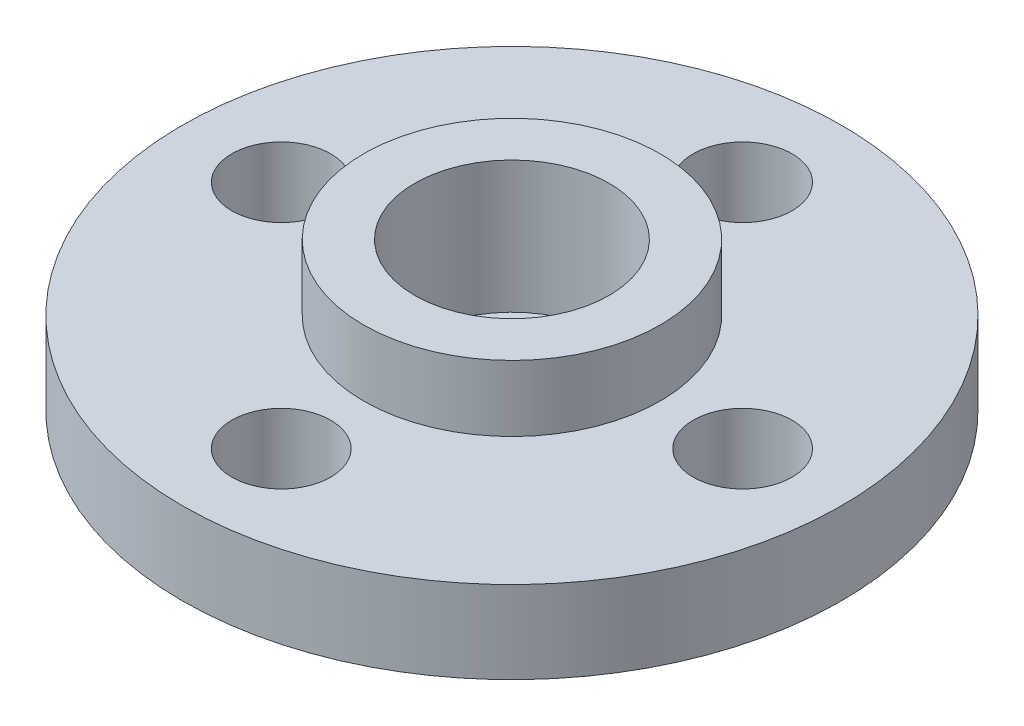
ISO-10303-21;
HEADER;
FILE_DESCRIPTION(('STEP AP214'),'2;1');
FILE_NAME('part.step','',(''),(''),'','','');
FILE_SCHEMA(('AUTOMOTIVE_DESIGN { 1 0 10303 214 1 1 1 1 }'));
ENDSEC;
DATA;
#1=APPLICATION_CONTEXT('core data for automotive mechanical design processes');
#2=APPLICATION_PROTOCOL_DEFINITION('international standard','automotive_design',2000,#1);
#3=PRODUCT_CONTEXT('',#1,'mechanical');
#4=PRODUCT('Part','Part','',(#3));
#5=PRODUCT_RELATED_PRODUCT_CATEGORY('part','',(#4));
#6=PRODUCT_DEFINITION_FORMATION('','',#4);
#7=PRODUCT_DEFINITION_CONTEXT('part definition',#1,'design');
#8=PRODUCT_DEFINITION('design','',#6,#7);
#9=PRODUCT_DEFINITION_SHAPE('','',#8);
#10=(LENGTH_UNIT() NAMED_UNIT(*) SI_UNIT(.MILLI.,.METRE.));
#11=(NAMED_UNIT(*) PLANE_ANGLE_UNIT() SI_UNIT($,.RADIAN.));
#12=(NAMED_UNIT(*) SI_UNIT($,.STERADIAN.) SOLID_ANGLE_UNIT());
#13=UNCERTAINTY_MEASURE_WITH_UNIT(LENGTH_MEASURE(1.E-05),#10,'distance_accuracy_value','');
#14=(GEOMETRIC_REPRESENTATION_CONTEXT(3) GLOBAL_UNCERTAINTY_ASSIGNED_CONTEXT((#13)) GLOBAL_UNIT_ASSIGNED_CONTEXT((#10,
#11,#12)) REPRESENTATION_CONTEXT('',''));
#15=CARTESIAN_POINT('',(0.,0.,0.));
#16=DIRECTION('',(0.,0.,1.));
#17=DIRECTION('',(1.,0.,0.));
#18=AXIS2_PLACEMENT_3D('',#15,#16,#17);
#19=CARTESIAN_POINT('',(0.,0.,0.));
#20=DIRECTION('',(0.,1.,0.));
#21=DIRECTION('',(0.,0.,1.));
#22=AXIS2_PLACEMENT_3D('',#19,#20,#21);
#23=CYLINDRICAL_SURFACE('',#22,1.6);
#24=CARTESIAN_POINT('',(0.,0.,0.));
#25=DIRECTION('',(0.,1.,0.));
#26=DIRECTION('',(0.,0.,1.));
#27=AXIS2_PLACEMENT_3D('',#24,#25,#26);
#28=CIRCLE('',#27,1.6);
#29=CARTESIAN_POINT('',(0.,0.,1.6));
#30=VERTEX_POINT('',#29);
#31=EDGE_CURVE('E83',#30,#30,#28,.T.);
#32=ORIENTED_EDGE('',*,*,#31,.F.);
#33=EDGE_LOOP('',(#32));
#34=FACE_BOUND('',#33,.T.);
#35=CARTESIAN_POINT('',(0.,0.5,0.));
#36=DIRECTION('',(0.,1.,0.));
#37=DIRECTION('',(0.,0.,1.));
#38=AXIS2_PLACEMENT_3D('',#35,#36,#37);
#39=CIRCLE('',#38,1.6);
#40=CARTESIAN_POINT('',(0.,0.5,1.6));
#41=VERTEX_POINT('',#40);
#42=EDGE_CURVE('E89',#41,#41,#39,.T.);
#43=ORIENTED_EDGE('',*,*,#42,.T.);
#44=EDGE_LOOP('',(#43));
#45=FACE_BOUND('',#44,.T.);
#46=ADVANCED_FACE('F38',(#34,#45),#23,.F.);
#47=CARTESIAN_POINT('',(0.,2.5,0.));
#48=DIRECTION('',(0.,1.,0.));
#49=DIRECTION('',(0.,0.,1.));
#50=AXIS2_PLACEMENT_3D('',#47,#48,#49);
#51=PLANE('',#50);
#52=CARTESIAN_POINT('',(0.,2.5,0.));
#53=DIRECTION('',(0.,1.,0.));
#54=DIRECTION('',(0.,0.,1.));
#55=AXIS2_PLACEMENT_3D('',#52,#53,#54);
#56=CIRCLE('',#55,4.5);
#57=CARTESIAN_POINT('',(0.,2.5,4.5));
#58=VERTEX_POINT('',#57);
#59=EDGE_CURVE('E75',#58,#58,#56,.T.);
#60=ORIENTED_EDGE('',*,*,#59,.F.);
#61=EDGE_LOOP('',(#60));
#62=FACE_BOUND('',#61,.T.);
#63=CARTESIAN_POINT('',(1.96380207734619E-13,2.5,7.));
#64=DIRECTION('',(0.,1.,0.));
#65=DIRECTION('',(0.,0.,1.));
#66=AXIS2_PLACEMENT_3D('',#63,#64,#65);
#67=CIRCLE('',#66,1.50000000000023);
#68=CARTESIAN_POINT('',(1.96380207734619E-13,2.5,8.50000000000023));
#69=VERTEX_POINT('',#68);
#70=EDGE_CURVE('E60',#69,#69,#67,.T.);
#71=ORIENTED_EDGE('',*,*,#70,.F.);
#72=EDGE_LOOP('',(#71));
#73=FACE_BOUND('',#72,.T.);
#74=CARTESIAN_POINT('',(0.,2.5,-7.));
#75=DIRECTION('',(0.,1.,0.));
#76=DIRECTION('',(0.,0.,1.));
#77=AXIS2_PLACEMENT_3D('',#74,#75,#76);
#78=CIRCLE('',#77,1.5);
#79=CARTESIAN_POINT('',(0.,2.5,-5.5));
#80=VERTEX_POINT('',#79);
#81=EDGE_CURVE('E49',#80,#80,#78,.T.);
#82=ORIENTED_EDGE('',*,*,#81,.F.);
#83=EDGE_LOOP('',(#82));
#84=FACE_BOUND('',#83,.T.);
#85=CARTESIAN_POINT('',(0.,2.5,0.));
#86=DIRECTION('',(0.,1.,0.));
#87=DIRECTION('',(0.,0.,1.));
#88=AXIS2_PLACEMENT_3D('',#85,#86,#87);
#89=CIRCLE('',#88,10.);
#90=CARTESIAN_POINT('',(0.,2.5,10.));
#91=VERTEX_POINT('',#90);
#92=EDGE_CURVE('E10',#91,#91,#89,.T.);
#93=ORIENTED_EDGE('',*,*,#92,.T.);
#94=EDGE_LOOP('',(#93));
#95=FACE_BOUND('',#94,.T.);
#96=CARTESIAN_POINT('',(7.,2.5,0.));
#97=DIRECTION('',(0.,1.,0.));
#98=DIRECTION('',(0.,0.,1.));
#99=AXIS2_PLACEMENT_3D('',#96,#97,#98);
#100=CIRCLE('',#99,1.5);
#101=CARTESIAN_POINT('',(7.,2.5,1.50000000000002));
#102=VERTEX_POINT('',#101);
#103=EDGE_CURVE('E54',#102,#102,#100,.T.);
#104=ORIENTED_EDGE('',*,*,#103,.F.);
#105=EDGE_LOOP('',(#104));
#106=FACE_BOUND('',#105,.T.);
#107=CARTESIAN_POINT('',(-7.,2.5,0.));
#108=DIRECTION('',(0.,1.,0.));
#109=DIRECTION('',(0.,0.,1.));
#110=AXIS2_PLACEMENT_3D('',#107,#108,#109);
#111=CIRCLE('',#110,1.5);
#112=CARTESIAN_POINT('',(-7.,2.5,1.49999999999993));
#113=VERTEX_POINT('',#112);
#114=EDGE_CURVE('E66',#113,#113,#111,.T.);
#115=ORIENTED_EDGE('',*,*,#114,.F.);
#116=EDGE_LOOP('',(#115));
#117=FACE_BOUND('',#116,.T.);
#118=ADVANCED_FACE('F114',(#62,#73,#84,#95,#106,#117),#51,.T.);
#119=CARTESIAN_POINT('',(0.,0.,0.));
#120=DIRECTION('',(0.,1.,0.));
#121=DIRECTION('',(0.,0.,1.));
#122=AXIS2_PLACEMENT_3D('',#119,#120,#121);
#123=PLANE('',#122);
#124=ORIENTED_EDGE('',*,*,#31,.T.);
#125=EDGE_LOOP('',(#124));
#126=FACE_BOUND('',#125,.T.);
#127=CARTESIAN_POINT('',(0.,0.,0.));
#128=DIRECTION('',(0.,1.,0.));
#129=DIRECTION('',(0.,0.,1.));
#130=AXIS2_PLACEMENT_3D('',#127,#128,#129);
#131=CIRCLE('',#130,10.);
#132=CARTESIAN_POINT('',(0.,0.,10.));
#133=VERTEX_POINT('',#132);
#134=EDGE_CURVE('E42',#133,#133,#131,.T.);
#135=ORIENTED_EDGE('',*,*,#134,.F.);
#136=EDGE_LOOP('',(#135));
#137=FACE_BOUND('',#136,.T.);
#138=CARTESIAN_POINT('',(0.,0.,-7.));
#139=DIRECTION('',(0.,1.,0.));
#140=DIRECTION('',(0.,0.,1.));
#141=AXIS2_PLACEMENT_3D('',#138,#139,#140);
#142=CIRCLE('',#141,1.5);
#143=CARTESIAN_POINT('',(0.,0.,-5.5));
#144=VERTEX_POINT('',#143);
#145=EDGE_CURVE('E51',#144,#144,#142,.T.);
#146=ORIENTED_EDGE('',*,*,#145,.T.);
#147=EDGE_LOOP('',(#146));
#148=FACE_BOUND('',#147,.T.);
#149=CARTESIAN_POINT('',(7.,0.,0.));
#150=DIRECTION('',(0.,1.,0.));
#151=DIRECTION('',(0.,0.,1.));
#152=AXIS2_PLACEMENT_3D('',#149,#150,#151);
#153=CIRCLE('',#152,1.5);
#154=CARTESIAN_POINT('',(7.,0.,1.50000000000002));
#155=VERTEX_POINT('',#154);
#156=EDGE_CURVE('E57',#155,#155,#153,.T.);
#157=ORIENTED_EDGE('',*,*,#156,.T.);
#158=EDGE_LOOP('',(#157));
#159=FACE_BOUND('',#158,.T.);
#160=CARTESIAN_POINT('',(1.96380207734619E-13,0.,7.));
#161=DIRECTION('',(0.,1.,0.));
#162=DIRECTION('',(0.,0.,1.));
#163=AXIS2_PLACEMENT_3D('',#160,#161,#162);
#164=CIRCLE('',#163,1.50000000000023);
#165=CARTESIAN_POINT('',(1.96380207734619E-13,0.,8.50000000000023));
#166=VERTEX_POINT('',#165);
#167=EDGE_CURVE('E63',#166,#166,#164,.T.);
#168=ORIENTED_EDGE('',*,*,#167,.T.);
#169=EDGE_LOOP('',(#168));
#170=FACE_BOUND('',#169,.T.);
#171=CARTESIAN_POINT('',(-7.,0.,0.));
#172=DIRECTION('',(0.,1.,0.));
#173=DIRECTION('',(0.,0.,1.));
#174=AXIS2_PLACEMENT_3D('',#171,#172,#173);
#175=CIRCLE('',#174,1.5);
#176=CARTESIAN_POINT('',(-7.,0.,1.49999999999993));
#177=VERTEX_POINT('',#176);
#178=EDGE_CURVE('E69',#177,#177,#175,.T.);
#179=ORIENTED_EDGE('',*,*,#178,.T.);
#180=EDGE_LOOP('',(#179));
#181=FACE_BOUND('',#180,.T.);
#182=ADVANCED_FACE('F119',(#126,#137,#148,#159,#170,#181),#123,.F.);
#183=CARTESIAN_POINT('',(0.,2.5,0.));
#184=DIRECTION('',(0.,-1.,0.));
#185=DIRECTION('',(0.,0.,-1.));
#186=AXIS2_PLACEMENT_3D('',#183,#184,#185);
#187=CYLINDRICAL_SURFACE('',#186,10.);
#188=ORIENTED_EDGE('',*,*,#92,.F.);
#189=EDGE_LOOP('',(#188));
#190=FACE_BOUND('',#189,.T.);
#191=ORIENTED_EDGE('',*,*,#134,.T.);
#192=EDGE_LOOP('',(#191));
#193=FACE_BOUND('',#192,.T.);
#194=ADVANCED_FACE('F40',(#190,#193),#187,.T.);
#195=CARTESIAN_POINT('',(0.,2.5,-7.));
#196=DIRECTION('',(0.,-1.,0.));
#197=DIRECTION('',(0.,0.,-1.));
#198=AXIS2_PLACEMENT_3D('',#195,#196,#197);
#199=CYLINDRICAL_SURFACE('',#198,1.5);
#200=ORIENTED_EDGE('',*,*,#81,.T.);
#201=EDGE_LOOP('',(#200));
#202=FACE_BOUND('',#201,.T.);
#203=ORIENTED_EDGE('',*,*,#145,.F.);
#204=EDGE_LOOP('',(#203));
#205=FACE_BOUND('',#204,.T.);
#206=ADVANCED_FACE('F152',(#202,#205),#199,.F.);
#207=CARTESIAN_POINT('',(7.,2.5,0.));
#208=DIRECTION('',(0.,-1.,0.));
#209=DIRECTION('',(0.,0.,-1.));
#210=AXIS2_PLACEMENT_3D('',#207,#208,#209);
#211=CYLINDRICAL_SURFACE('',#210,1.5);
#212=ORIENTED_EDGE('',*,*,#103,.T.);
#213=EDGE_LOOP('',(#212));
#214=FACE_BOUND('',#213,.T.);
#215=ORIENTED_EDGE('',*,*,#156,.F.);
#216=EDGE_LOOP('',(#215));
#217=FACE_BOUND('',#216,.T.);
#218=ADVANCED_FACE('F146',(#214,#217),#211,.F.);
#219=CARTESIAN_POINT('',(1.96380207734619E-13,2.5,7.));
#220=DIRECTION('',(0.,-1.,0.));
#221=DIRECTION('',(0.,0.,-1.));
#222=AXIS2_PLACEMENT_3D('',#219,#220,#221);
#223=CYLINDRICAL_SURFACE('',#222,1.50000000000023);
#224=ORIENTED_EDGE('',*,*,#70,.T.);
#225=EDGE_LOOP('',(#224));
#226=FACE_BOUND('',#225,.T.);
#227=ORIENTED_EDGE('',*,*,#167,.F.);
#228=EDGE_LOOP('',(#227));
#229=FACE_BOUND('',#228,.T.);
#230=ADVANCED_FACE('F138',(#226,#229),#223,.F.);
#231=CARTESIAN_POINT('',(-7.,2.5,0.));
#232=DIRECTION('',(0.,-1.,0.));
#233=DIRECTION('',(0.,0.,-1.));
#234=AXIS2_PLACEMENT_3D('',#231,#232,#233);
#235=CYLINDRICAL_SURFACE('',#234,1.5);
#236=ORIENTED_EDGE('',*,*,#114,.T.);
#237=EDGE_LOOP('',(#236));
#238=FACE_BOUND('',#237,.T.);
#239=ORIENTED_EDGE('',*,*,#178,.F.);
#240=EDGE_LOOP('',(#239));
#241=FACE_BOUND('',#240,.T.);
#242=ADVANCED_FACE('F136',(#238,#241),#235,.F.);
#243=CARTESIAN_POINT('',(0.,4.5,0.));
#244=DIRECTION('',(0.,1.,0.));
#245=DIRECTION('',(0.,0.,1.));
#246=AXIS2_PLACEMENT_3D('',#243,#244,#245);
#247=PLANE('',#246);
#248=CARTESIAN_POINT('',(0.,4.5,0.));
#249=DIRECTION('',(0.,1.,0.));
#250=DIRECTION('',(0.,0.,1.));
#251=AXIS2_PLACEMENT_3D('',#248,#249,#250);
#252=CIRCLE('',#251,4.5);
#253=CARTESIAN_POINT('',(0.,4.5,4.5));
#254=VERTEX_POINT('',#253);
#255=EDGE_CURVE('E72',#254,#254,#252,.T.);
#256=ORIENTED_EDGE('',*,*,#255,.T.);
#257=EDGE_LOOP('',(#256));
#258=FACE_BOUND('',#257,.T.);
#259=CARTESIAN_POINT('',(0.,4.5,0.));
#260=DIRECTION('',(0.,1.,0.));
#261=DIRECTION('',(0.,0.,1.));
#262=AXIS2_PLACEMENT_3D('',#259,#260,#261);
#263=CIRCLE('',#262,2.95);
#264=CARTESIAN_POINT('',(0.,4.5,2.95));
#265=VERTEX_POINT('',#264);
#266=EDGE_CURVE('E78',#265,#265,#263,.T.);
#267=ORIENTED_EDGE('',*,*,#266,.F.);
#268=EDGE_LOOP('',(#267));
#269=FACE_BOUND('',#268,.T.);
#270=ADVANCED_FACE('F108',(#258,#269),#247,.T.);
#271=CARTESIAN_POINT('',(0.,4.5,0.));
#272=DIRECTION('',(0.,-1.,0.));
#273=DIRECTION('',(0.,0.,-1.));
#274=AXIS2_PLACEMENT_3D('',#271,#272,#273);
#275=CYLINDRICAL_SURFACE('',#274,4.5);
#276=ORIENTED_EDGE('',*,*,#255,.F.);
#277=EDGE_LOOP('',(#276));
#278=FACE_BOUND('',#277,.T.);
#279=ORIENTED_EDGE('',*,*,#59,.T.);
#280=EDGE_LOOP('',(#279));
#281=FACE_BOUND('',#280,.T.);
#282=ADVANCED_FACE('F102',(#278,#281),#275,.T.);
#283=CARTESIAN_POINT('',(0.,4.5,0.));
#284=DIRECTION('',(0.,-1.,0.));
#285=DIRECTION('',(0.,0.,-1.));
#286=AXIS2_PLACEMENT_3D('',#283,#284,#285);
#287=CYLINDRICAL_SURFACE('',#286,2.95);
#288=ORIENTED_EDGE('',*,*,#266,.T.);
#289=EDGE_LOOP('',(#288));
#290=FACE_BOUND('',#289,.T.);
#291=CARTESIAN_POINT('',(0.,0.5,0.));
#292=DIRECTION('',(0.,1.,0.));
#293=DIRECTION('',(0.,0.,1.));
#294=AXIS2_PLACEMENT_3D('',#291,#292,#293);
#295=CIRCLE('',#294,2.95);
#296=CARTESIAN_POINT('',(0.,0.5,2.95));
#297=VERTEX_POINT('',#296);
#298=EDGE_CURVE('E86',#297,#297,#295,.T.);
#299=ORIENTED_EDGE('',*,*,#298,.F.);
#300=EDGE_LOOP('',(#299));
#301=FACE_BOUND('',#300,.T.);
#302=ADVANCED_FACE('F97',(#290,#301),#287,.F.);
#303=CARTESIAN_POINT('',(0.,0.5,0.));
#304=DIRECTION('',(0.,1.,0.));
#305=DIRECTION('',(0.,0.,1.));
#306=AXIS2_PLACEMENT_3D('',#303,#304,#305);
#307=PLANE('',#306);
#308=ORIENTED_EDGE('',*,*,#42,.F.);
#309=EDGE_LOOP('',(#308));
#310=FACE_BOUND('',#309,.T.);
#311=ORIENTED_EDGE('',*,*,#298,.T.);
#312=EDGE_LOOP('',(#311));
#313=FACE_BOUND('',#312,.T.);
#314=ADVANCED_FACE('F94',(#310,#313),#307,.T.);
#315=CLOSED_SHELL('',(#46,#118,#182,#194,#206,#218,#230,#242,#270,#282,#302,#314));
#316=MANIFOLD_SOLID_BREP('B2',#315);
#317=ADVANCED_BREP_SHAPE_REPRESENTATION('',(#18,#316),#14);
#318=SHAPE_DEFINITION_REPRESENTATION(#9,#317);
ENDSEC;
END-ISO-10303-21;
